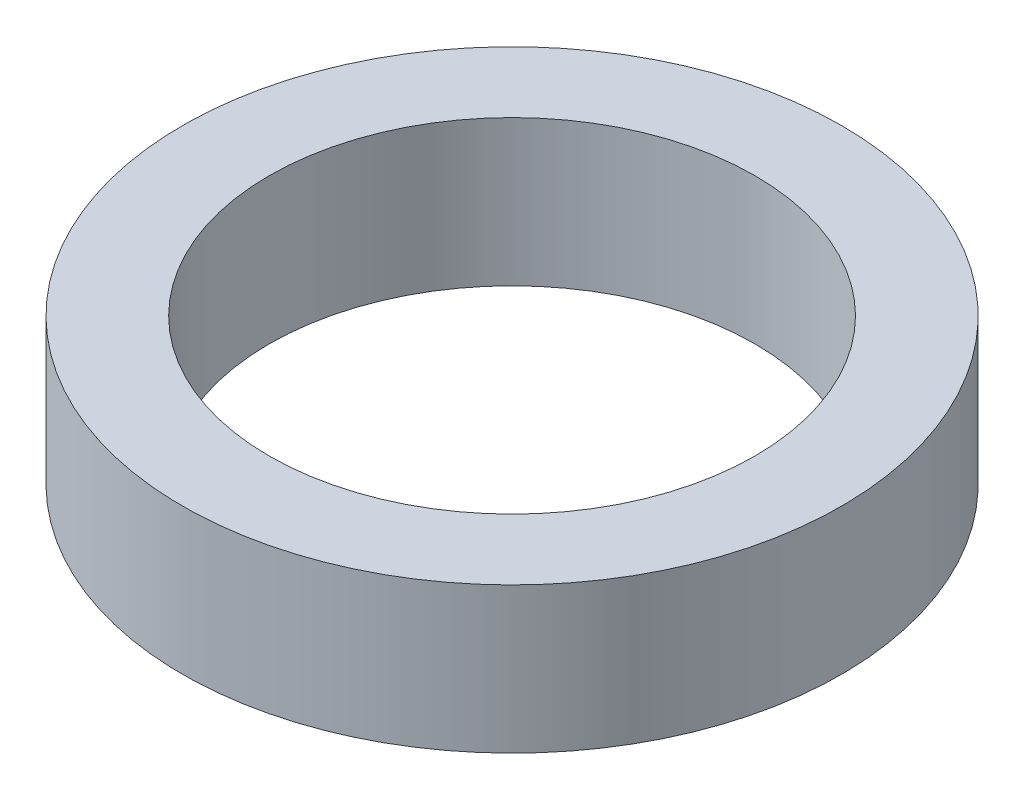
ISO-10303-21;
HEADER;
FILE_DESCRIPTION(('STEP AP214'),'2;1');
FILE_NAME('part.step','',(''),(''),'','','');
FILE_SCHEMA(('AUTOMOTIVE_DESIGN { 1 0 10303 214 1 1 1 1 }'));
ENDSEC;
DATA;
#1=APPLICATION_CONTEXT('core data for automotive mechanical design processes');
#2=APPLICATION_PROTOCOL_DEFINITION('international standard','automotive_design',2000,#1);
#3=PRODUCT_CONTEXT('',#1,'mechanical');
#4=PRODUCT('Part','Part','',(#3));
#5=PRODUCT_RELATED_PRODUCT_CATEGORY('part','',(#4));
#6=PRODUCT_DEFINITION_FORMATION('','',#4);
#7=PRODUCT_DEFINITION_CONTEXT('part definition',#1,'design');
#8=PRODUCT_DEFINITION('design','',#6,#7);
#9=PRODUCT_DEFINITION_SHAPE('','',#8);
#10=(LENGTH_UNIT() NAMED_UNIT(*) SI_UNIT(.MILLI.,.METRE.));
#11=(NAMED_UNIT(*) PLANE_ANGLE_UNIT() SI_UNIT($,.RADIAN.));
#12=(NAMED_UNIT(*) SI_UNIT($,.STERADIAN.) SOLID_ANGLE_UNIT());
#13=UNCERTAINTY_MEASURE_WITH_UNIT(LENGTH_MEASURE(1.E-05),#10,'distance_accuracy_value','');
#14=(GEOMETRIC_REPRESENTATION_CONTEXT(3) GLOBAL_UNCERTAINTY_ASSIGNED_CONTEXT((#13)) GLOBAL_UNIT_ASSIGNED_CONTEXT((#10,
#11,#12)) REPRESENTATION_CONTEXT('',''));
#15=CARTESIAN_POINT('',(0.,0.,0.));
#16=DIRECTION('',(0.,0.,1.));
#17=DIRECTION('',(1.,0.,0.));
#18=AXIS2_PLACEMENT_3D('',#15,#16,#17);
#19=CARTESIAN_POINT('',(0.,21.,0.));
#20=DIRECTION('',(0.,-1.,0.));
#21=DIRECTION('',(0.,0.,-1.));
#22=AXIS2_PLACEMENT_3D('',#19,#20,#21);
#23=CYLINDRICAL_SURFACE('',#22,47.5);
#24=CARTESIAN_POINT('',(0.,21.,0.));
#25=DIRECTION('',(0.,1.,0.));
#26=DIRECTION('',(0.,0.,1.));
#27=AXIS2_PLACEMENT_3D('',#24,#25,#26);
#28=CIRCLE('',#27,47.5);
#29=CARTESIAN_POINT('',(0.,21.,-47.5));
#30=VERTEX_POINT('',#29);
#31=EDGE_CURVE('E10',#30,#30,#28,.T.);
#32=CARTESIAN_POINT('',(0.,0.,0.));
#33=DIRECTION('',(0.,1.,0.));
#34=DIRECTION('',(0.,0.,1.));
#35=AXIS2_PLACEMENT_3D('',#32,#33,#34);
#36=CIRCLE('',#35,47.5);
#37=CARTESIAN_POINT('',(0.,0.,-47.5));
#38=VERTEX_POINT('',#37);
#39=EDGE_CURVE('E37',#38,#38,#36,.T.);
#40=CARTESIAN_POINT('',(0.,21.,-47.5));
#41=CARTESIAN_POINT('',(0.,20.78125,-47.5));
#42=CARTESIAN_POINT('',(0.,20.5625,-47.5));
#43=CARTESIAN_POINT('',(0.,20.125,-47.5));
#44=CARTESIAN_POINT('',(0.,19.90625,-47.5));
#45=CARTESIAN_POINT('',(0.,19.46875,-47.5));
#46=CARTESIAN_POINT('',(0.,19.25,-47.5));
#47=CARTESIAN_POINT('',(0.,18.8125,-47.5));
#48=CARTESIAN_POINT('',(0.,18.59375,-47.5));
#49=CARTESIAN_POINT('',(0.,18.15625,-47.5));
#50=CARTESIAN_POINT('',(0.,17.9375,-47.5));
#51=CARTESIAN_POINT('',(0.,17.5,-47.5));
#52=CARTESIAN_POINT('',(0.,17.28125,-47.5));
#53=CARTESIAN_POINT('',(0.,16.84375,-47.5));
#54=CARTESIAN_POINT('',(0.,16.625,-47.5));
#55=CARTESIAN_POINT('',(0.,16.1875,-47.5));
#56=CARTESIAN_POINT('',(0.,15.96875,-47.5));
#57=CARTESIAN_POINT('',(0.,15.53125,-47.5));
#58=CARTESIAN_POINT('',(0.,15.3125,-47.5));
#59=CARTESIAN_POINT('',(0.,14.875,-47.5));
#60=CARTESIAN_POINT('',(0.,14.65625,-47.5));
#61=CARTESIAN_POINT('',(0.,14.21875,-47.5));
#62=CARTESIAN_POINT('',(0.,14.,-47.5));
#63=CARTESIAN_POINT('',(0.,13.5625,-47.5));
#64=CARTESIAN_POINT('',(0.,13.34375,-47.5));
#65=CARTESIAN_POINT('',(0.,12.90625,-47.5));
#66=CARTESIAN_POINT('',(0.,12.6875,-47.5));
#67=CARTESIAN_POINT('',(0.,12.25,-47.5));
#68=CARTESIAN_POINT('',(0.,12.03125,-47.5));
#69=CARTESIAN_POINT('',(0.,11.59375,-47.5));
#70=CARTESIAN_POINT('',(0.,11.375,-47.5));
#71=CARTESIAN_POINT('',(0.,10.9375,-47.5));
#72=CARTESIAN_POINT('',(0.,10.71875,-47.5));
#73=CARTESIAN_POINT('',(0.,10.28125,-47.5));
#74=CARTESIAN_POINT('',(0.,10.0625,-47.5));
#75=CARTESIAN_POINT('',(0.,9.625,-47.5));
#76=CARTESIAN_POINT('',(0.,9.40625,-47.5));
#77=CARTESIAN_POINT('',(0.,8.96875,-47.5));
#78=CARTESIAN_POINT('',(0.,8.75,-47.5));
#79=CARTESIAN_POINT('',(0.,8.3125,-47.5));
#80=CARTESIAN_POINT('',(0.,8.09375,-47.5));
#81=CARTESIAN_POINT('',(0.,7.65625,-47.5));
#82=CARTESIAN_POINT('',(0.,7.4375,-47.5));
#83=CARTESIAN_POINT('',(0.,7.,-47.5));
#84=CARTESIAN_POINT('',(0.,6.78125,-47.5));
#85=CARTESIAN_POINT('',(0.,6.34375,-47.5));
#86=CARTESIAN_POINT('',(0.,6.125,-47.5));
#87=CARTESIAN_POINT('',(0.,5.6875,-47.5));
#88=CARTESIAN_POINT('',(0.,5.46875,-47.5));
#89=CARTESIAN_POINT('',(0.,5.03125,-47.5));
#90=CARTESIAN_POINT('',(0.,4.8125,-47.5));
#91=CARTESIAN_POINT('',(0.,4.375,-47.5));
#92=CARTESIAN_POINT('',(0.,4.15625,-47.5));
#93=CARTESIAN_POINT('',(0.,3.71875,-47.5));
#94=CARTESIAN_POINT('',(0.,3.5,-47.5));
#95=CARTESIAN_POINT('',(0.,3.0625,-47.5));
#96=CARTESIAN_POINT('',(0.,2.84375,-47.5));
#97=CARTESIAN_POINT('',(0.,2.40625,-47.5));
#98=CARTESIAN_POINT('',(0.,2.1875,-47.5));
#99=CARTESIAN_POINT('',(0.,1.75,-47.5));
#100=CARTESIAN_POINT('',(0.,1.53125,-47.5));
#101=CARTESIAN_POINT('',(0.,1.09375,-47.5));
#102=CARTESIAN_POINT('',(0.,0.875000000000001,-47.5));
#103=CARTESIAN_POINT('',(0.,0.4375,-47.5));
#104=CARTESIAN_POINT('',(0.,0.21875,-47.5));
#105=CARTESIAN_POINT('',(0.,0.,-47.5));
#106=B_SPLINE_CURVE_WITH_KNOTS('',3,(#40,#41,#42,#43,#44,#45,#46,#47,#48,#49,#50,#51,#52,#53,
#54,#55,#56,#57,#58,#59,#60,#61,#62,#63,#64,#65,#66,#67,#68,#69,#70,#71,#72,#73,#74,#75,#76,#77,
#78,#79,#80,#81,#82,#83,#84,#85,#86,#87,#88,#89,#90,#91,#92,#93,#94,#95,#96,#97,#98,#99,#100,
#101,#102,#103,#104,#105),.UNSPECIFIED.,.F.,.F.,(4,2,2,2,2,2,2,2,2,2,2,2,2,2,2,2,2,2,2,2,2,2,2,
2,2,2,2,2,2,2,2,2,4),(0.,0.656249999999997,1.3125,1.96875,2.625,3.28125,3.9375,4.59375,5.25,
5.90625,6.5625,7.21875,7.875,8.53125,9.1875,9.84375,10.5,11.15625,11.8125,12.46875,13.125,
13.78125,14.4375,15.09375,15.75,16.40625,17.0625,17.71875,18.375,19.03125,19.6875,20.34375,21.),.UNSPECIFIED.);
#107=EDGE_CURVE('BSEAM40',#30,#38,#106,.T.);
#108=ORIENTED_EDGE('',*,*,#31,.F.);
#109=ORIENTED_EDGE('',*,*,#39,.T.);
#110=ORIENTED_EDGE('',*,*,#107,.T.);
#111=ORIENTED_EDGE('',*,*,#107,.F.);
#112=EDGE_LOOP('',(#108,#110,#109,#111));
#113=FACE_BOUND('',#112,.T.);
#114=ADVANCED_FACE('F40',(#113),#23,.T.);
#115=CARTESIAN_POINT('',(0.,21.,0.));
#116=DIRECTION('',(0.,1.,0.));
#117=DIRECTION('',(0.,0.,1.));
#118=AXIS2_PLACEMENT_3D('',#115,#116,#117);
#119=PLANE('',#118);
#120=CARTESIAN_POINT('',(0.,21.,0.));
#121=DIRECTION('',(0.,1.,0.));
#122=DIRECTION('',(0.,0.,1.));
#123=AXIS2_PLACEMENT_3D('',#120,#121,#122);
#124=CIRCLE('',#123,35.);
#125=CARTESIAN_POINT('',(0.,21.,-35.));
#126=VERTEX_POINT('',#125);
#127=EDGE_CURVE('E50',#126,#126,#124,.T.);
#128=ORIENTED_EDGE('',*,*,#127,.F.);
#129=EDGE_LOOP('',(#128));
#130=FACE_BOUND('',#129,.T.);
#131=ORIENTED_EDGE('',*,*,#31,.T.);
#132=EDGE_LOOP('',(#131));
#133=FACE_BOUND('',#132,.T.);
#134=ADVANCED_FACE('F59',(#130,#133),#119,.T.);
#135=CARTESIAN_POINT('',(0.,0.,0.));
#136=DIRECTION('',(0.,1.,0.));
#137=DIRECTION('',(0.,0.,1.));
#138=AXIS2_PLACEMENT_3D('',#135,#136,#137);
#139=PLANE('',#138);
#140=CARTESIAN_POINT('',(0.,0.,0.));
#141=DIRECTION('',(0.,1.,0.));
#142=DIRECTION('',(0.,0.,1.));
#143=AXIS2_PLACEMENT_3D('',#140,#141,#142);
#144=CIRCLE('',#143,35.);
#145=CARTESIAN_POINT('',(0.,0.,-35.));
#146=VERTEX_POINT('',#145);
#147=EDGE_CURVE('E47',#146,#146,#144,.T.);
#148=ORIENTED_EDGE('',*,*,#147,.T.);
#149=EDGE_LOOP('',(#148));
#150=FACE_BOUND('',#149,.T.);
#151=ORIENTED_EDGE('',*,*,#39,.F.);
#152=EDGE_LOOP('',(#151));
#153=FACE_BOUND('',#152,.T.);
#154=ADVANCED_FACE('F58',(#150,#153),#139,.F.);
#155=CARTESIAN_POINT('',(0.,21.,0.));
#156=DIRECTION('',(0.,-1.,0.));
#157=DIRECTION('',(0.,0.,-1.));
#158=AXIS2_PLACEMENT_3D('',#155,#156,#157);
#159=CYLINDRICAL_SURFACE('',#158,35.);
#160=CARTESIAN_POINT('',(0.,21.,-35.));
#161=CARTESIAN_POINT('',(0.,20.78125,-35.));
#162=CARTESIAN_POINT('',(0.,20.5625,-35.));
#163=CARTESIAN_POINT('',(0.,20.125,-35.));
#164=CARTESIAN_POINT('',(0.,19.90625,-35.));
#165=CARTESIAN_POINT('',(0.,19.46875,-35.));
#166=CARTESIAN_POINT('',(0.,19.25,-35.));
#167=CARTESIAN_POINT('',(0.,18.8125,-35.));
#168=CARTESIAN_POINT('',(0.,18.59375,-35.));
#169=CARTESIAN_POINT('',(0.,18.15625,-35.));
#170=CARTESIAN_POINT('',(0.,17.9375,-35.));
#171=CARTESIAN_POINT('',(0.,17.5,-35.));
#172=CARTESIAN_POINT('',(0.,17.28125,-35.));
#173=CARTESIAN_POINT('',(0.,16.84375,-35.));
#174=CARTESIAN_POINT('',(0.,16.625,-35.));
#175=CARTESIAN_POINT('',(0.,16.1875,-35.));
#176=CARTESIAN_POINT('',(0.,15.96875,-35.));
#177=CARTESIAN_POINT('',(0.,15.53125,-35.));
#178=CARTESIAN_POINT('',(0.,15.3125,-35.));
#179=CARTESIAN_POINT('',(0.,14.875,-35.));
#180=CARTESIAN_POINT('',(0.,14.65625,-35.));
#181=CARTESIAN_POINT('',(0.,14.21875,-35.));
#182=CARTESIAN_POINT('',(0.,14.,-35.));
#183=CARTESIAN_POINT('',(0.,13.5625,-35.));
#184=CARTESIAN_POINT('',(0.,13.34375,-35.));
#185=CARTESIAN_POINT('',(0.,12.90625,-35.));
#186=CARTESIAN_POINT('',(0.,12.6875,-35.));
#187=CARTESIAN_POINT('',(0.,12.25,-35.));
#188=CARTESIAN_POINT('',(0.,12.03125,-35.));
#189=CARTESIAN_POINT('',(0.,11.59375,-35.));
#190=CARTESIAN_POINT('',(0.,11.375,-35.));
#191=CARTESIAN_POINT('',(0.,10.9375,-35.));
#192=CARTESIAN_POINT('',(0.,10.71875,-35.));
#193=CARTESIAN_POINT('',(0.,10.28125,-35.));
#194=CARTESIAN_POINT('',(0.,10.0625,-35.));
#195=CARTESIAN_POINT('',(0.,9.625,-35.));
#196=CARTESIAN_POINT('',(0.,9.40625,-35.));
#197=CARTESIAN_POINT('',(0.,8.96875,-35.));
#198=CARTESIAN_POINT('',(0.,8.75,-35.));
#199=CARTESIAN_POINT('',(0.,8.3125,-35.));
#200=CARTESIAN_POINT('',(0.,8.09375,-35.));
#201=CARTESIAN_POINT('',(0.,7.65625,-35.));
#202=CARTESIAN_POINT('',(0.,7.4375,-35.));
#203=CARTESIAN_POINT('',(0.,7.,-35.));
#204=CARTESIAN_POINT('',(0.,6.78125,-35.));
#205=CARTESIAN_POINT('',(0.,6.34375,-35.));
#206=CARTESIAN_POINT('',(0.,6.125,-35.));
#207=CARTESIAN_POINT('',(0.,5.6875,-35.));
#208=CARTESIAN_POINT('',(0.,5.46875,-35.));
#209=CARTESIAN_POINT('',(0.,5.03125,-35.));
#210=CARTESIAN_POINT('',(0.,4.8125,-35.));
#211=CARTESIAN_POINT('',(0.,4.375,-35.));
#212=CARTESIAN_POINT('',(0.,4.15625,-35.));
#213=CARTESIAN_POINT('',(0.,3.71875,-35.));
#214=CARTESIAN_POINT('',(0.,3.5,-35.));
#215=CARTESIAN_POINT('',(0.,3.0625,-35.));
#216=CARTESIAN_POINT('',(0.,2.84375,-35.));
#217=CARTESIAN_POINT('',(0.,2.40625,-35.));
#218=CARTESIAN_POINT('',(0.,2.1875,-35.));
#219=CARTESIAN_POINT('',(0.,1.75,-35.));
#220=CARTESIAN_POINT('',(0.,1.53125,-35.));
#221=CARTESIAN_POINT('',(0.,1.09375,-35.));
#222=CARTESIAN_POINT('',(0.,0.875000000000001,-35.));
#223=CARTESIAN_POINT('',(0.,0.4375,-35.));
#224=CARTESIAN_POINT('',(0.,0.21875,-35.));
#225=CARTESIAN_POINT('',(0.,0.,-35.));
#226=B_SPLINE_CURVE_WITH_KNOTS('',3,(#160,#161,#162,#163,#164,#165,#166,#167,#168,#169,#170,
#171,#172,#173,#174,#175,#176,#177,#178,#179,#180,#181,#182,#183,#184,#185,#186,#187,#188,#189,
#190,#191,#192,#193,#194,#195,#196,#197,#198,#199,#200,#201,#202,#203,#204,#205,#206,#207,#208,
#209,#210,#211,#212,#213,#214,#215,#216,#217,#218,#219,#220,#221,#222,#223,#224,#225),
.UNSPECIFIED.,.F.,.F.,(4,2,2,2,2,2,2,2,2,2,2,2,2,2,2,2,2,2,2,2,2,2,2,2,2,2,2,2,2,2,2,2,4),(0.,
0.656250000000001,1.3125,1.96875,2.625,3.28125,3.9375,4.59375,5.25,5.90625,6.5625,7.21875,7.875,
8.53125,9.1875,9.84375,10.5,11.15625,11.8125,12.46875,13.125,13.78125,14.4375,15.09375,15.75,
16.40625,17.0625,17.71875,18.375,19.03125,19.6875,20.34375,21.),.UNSPECIFIED.);
#227=EDGE_CURVE('BSEAM54',#126,#146,#226,.T.);
#228=ORIENTED_EDGE('',*,*,#127,.T.);
#229=ORIENTED_EDGE('',*,*,#147,.F.);
#230=ORIENTED_EDGE('',*,*,#227,.T.);
#231=ORIENTED_EDGE('',*,*,#227,.F.);
#232=EDGE_LOOP('',(#228,#230,#229,#231));
#233=FACE_BOUND('',#232,.T.);
#234=ADVANCED_FACE('F54',(#233),#159,.F.);
#235=CLOSED_SHELL('',(#114,#134,#154,#234));
#236=MANIFOLD_SOLID_BREP('B2',#235);
#237=ADVANCED_BREP_SHAPE_REPRESENTATION('',(#18,#236),#14);
#238=SHAPE_DEFINITION_REPRESENTATION(#9,#237);
ENDSEC;
END-ISO-10303-21;
